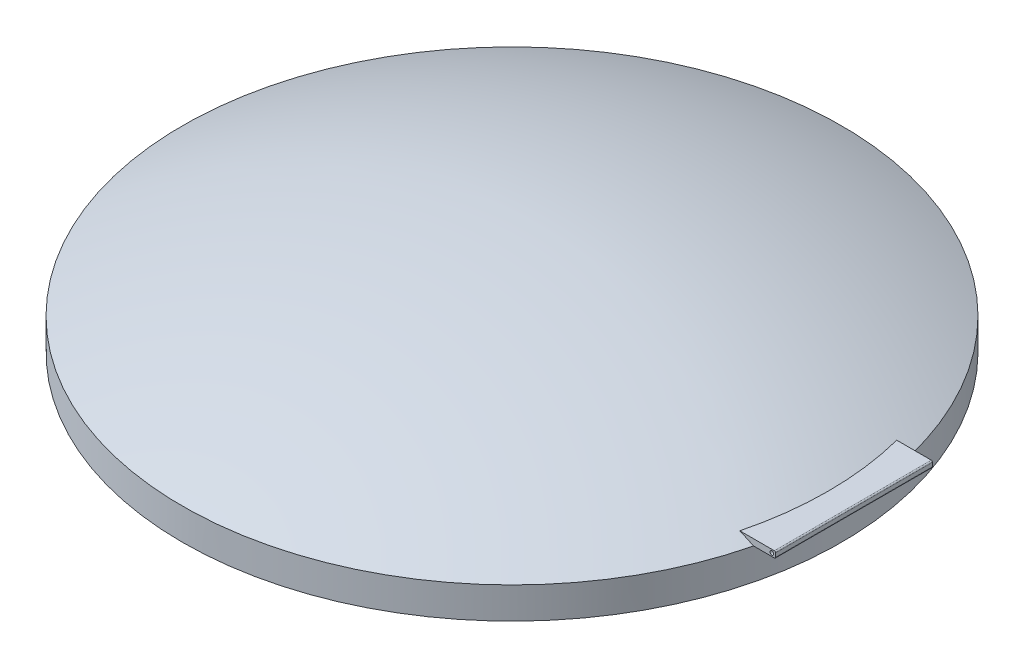
ISO-10303-21;
HEADER;
FILE_DESCRIPTION(('STEP AP214'),'2;1');
FILE_NAME('part.step','',(''),(''),'','','');
FILE_SCHEMA(('AUTOMOTIVE_DESIGN { 1 0 10303 214 1 1 1 1 }'));
ENDSEC;
DATA;
#1=APPLICATION_CONTEXT('core data for automotive mechanical design processes');
#2=APPLICATION_PROTOCOL_DEFINITION('international standard','automotive_design',2000,#1);
#3=PRODUCT_CONTEXT('',#1,'mechanical');
#4=PRODUCT('Part','Part','',(#3));
#5=PRODUCT_RELATED_PRODUCT_CATEGORY('part','',(#4));
#6=PRODUCT_DEFINITION_FORMATION('','',#4);
#7=PRODUCT_DEFINITION_CONTEXT('part definition',#1,'design');
#8=PRODUCT_DEFINITION('design','',#6,#7);
#9=PRODUCT_DEFINITION_SHAPE('','',#8);
#10=(LENGTH_UNIT() NAMED_UNIT(*) SI_UNIT(.MILLI.,.METRE.));
#11=(NAMED_UNIT(*) PLANE_ANGLE_UNIT() SI_UNIT($,.RADIAN.));
#12=(NAMED_UNIT(*) SI_UNIT($,.STERADIAN.) SOLID_ANGLE_UNIT());
#13=UNCERTAINTY_MEASURE_WITH_UNIT(LENGTH_MEASURE(1.E-05),#10,'distance_accuracy_value','');
#14=(GEOMETRIC_REPRESENTATION_CONTEXT(3) GLOBAL_UNCERTAINTY_ASSIGNED_CONTEXT((#13)) GLOBAL_UNIT_ASSIGNED_CONTEXT((#10,
#11,#12)) REPRESENTATION_CONTEXT('',''));
#15=CARTESIAN_POINT('',(0.,0.,0.));
#16=DIRECTION('',(0.,0.,1.));
#17=DIRECTION('',(1.,0.,0.));
#18=AXIS2_PLACEMENT_3D('',#15,#16,#17);
#19=CARTESIAN_POINT('',(0.,0.25,0.));
#20=DIRECTION('',(0.,-1.,0.));
#21=DIRECTION('',(0.,0.,-1.));
#22=AXIS2_PLACEMENT_3D('',#19,#20,#21);
#23=CYLINDRICAL_SURFACE('',#22,2.625);
#24=CARTESIAN_POINT('',(0.,0.25,0.));
#25=DIRECTION('',(0.,1.,0.));
#26=DIRECTION('',(0.,0.,1.));
#27=AXIS2_PLACEMENT_3D('',#24,#25,#26);
#28=CIRCLE('',#27,2.625);
#29=CARTESIAN_POINT('',(2.54950975679639,0.25,0.624999999999999));
#30=VERTEX_POINT('',#29);
#31=CARTESIAN_POINT('',(2.54950975679639,0.25,-0.624999999999999));
#32=VERTEX_POINT('',#31);
#33=EDGE_CURVE('E127',#30,#32,#28,.T.);
#34=ORIENTED_EDGE('',*,*,#33,.F.);
#35=EDGE_CURVE('E126',#32,#30,#28,.T.);
#36=ORIENTED_EDGE('',*,*,#35,.F.);
#37=EDGE_LOOP('',(#34,#36));
#38=FACE_BOUND('',#37,.T.);
#39=CARTESIAN_POINT('',(0.,0.,0.));
#40=DIRECTION('',(0.,1.,0.));
#41=DIRECTION('',(0.,0.,1.));
#42=AXIS2_PLACEMENT_3D('',#39,#40,#41);
#43=CIRCLE('',#42,2.625);
#44=CARTESIAN_POINT('',(0.,0.,2.625));
#45=VERTEX_POINT('',#44);
#46=EDGE_CURVE('E121',#45,#45,#43,.T.);
#47=ORIENTED_EDGE('',*,*,#46,.T.);
#48=EDGE_LOOP('',(#47));
#49=FACE_BOUND('',#48,.T.);
#50=ADVANCED_FACE('F32',(#38,#49),#23,.T.);
#51=CARTESIAN_POINT('',(0.,-5.1921875,0.));
#52=DIRECTION('',(0.,0.,1.));
#53=DIRECTION('',(1.,0.,0.));
#54=AXIS2_PLACEMENT_3D('',#51,#52,#53);
#55=SPHERICAL_SURFACE('',#54,6.0421875);
#56=CARTESIAN_POINT('',(0.,-5.19218750000001,0.624999999999952));
#57=DIRECTION('',(0.,0.,1.));
#58=DIRECTION('',(0.,-1.,0.));
#59=AXIS2_PLACEMENT_3D('',#56,#57,#58);
#60=CIRCLE('',#59,6.00977576829255);
#61=CARTESIAN_POINT('',(2.43993468150277,0.299999999999998,0.625));
#62=VERTEX_POINT('',#61);
#63=EDGE_CURVE('E92',#30,#62,#60,.T.);
#64=ORIENTED_EDGE('',*,*,#63,.T.);
#65=CARTESIAN_POINT('',(0.,0.299999999999998,0.));
#66=DIRECTION('',(0.,1.,0.));
#67=DIRECTION('',(0.,0.,1.));
#68=AXIS2_PLACEMENT_3D('',#65,#66,#67);
#69=CIRCLE('',#68,2.51871122798943);
#70=CARTESIAN_POINT('',(2.43993468150277,0.299999999999998,-0.625));
#71=VERTEX_POINT('',#70);
#72=EDGE_CURVE('E86',#62,#71,#69,.T.);
#73=ORIENTED_EDGE('',*,*,#72,.T.);
#74=CARTESIAN_POINT('',(0.,-5.1921875,-0.625));
#75=DIRECTION('',(0.,0.,-1.));
#76=DIRECTION('',(-1.,0.,0.));
#77=AXIS2_PLACEMENT_3D('',#74,#75,#76);
#78=CIRCLE('',#77,6.00977576829255);
#79=EDGE_CURVE('E89',#71,#32,#78,.T.);
#80=ORIENTED_EDGE('',*,*,#79,.T.);
#81=ORIENTED_EDGE('',*,*,#35,.T.);
#82=EDGE_LOOP('',(#64,#73,#80,#81));
#83=FACE_BOUND('',#82,.T.);
#84=ADVANCED_FACE('F88',(#83),#55,.T.);
#85=CARTESIAN_POINT('',(0.,0.,0.));
#86=DIRECTION('',(0.,1.,0.));
#87=DIRECTION('',(0.,0.,1.));
#88=AXIS2_PLACEMENT_3D('',#85,#86,#87);
#89=PLANE('',#88);
#90=CARTESIAN_POINT('',(0.,0.,0.));
#91=DIRECTION('',(0.,1.,0.));
#92=DIRECTION('',(0.,0.,1.));
#93=AXIS2_PLACEMENT_3D('',#90,#91,#92);
#94=CIRCLE('',#93,2.525);
#95=CARTESIAN_POINT('',(0.,0.,2.525));
#96=VERTEX_POINT('',#95);
#97=EDGE_CURVE('E110',#96,#96,#94,.T.);
#98=ORIENTED_EDGE('',*,*,#97,.T.);
#99=EDGE_LOOP('',(#98));
#100=FACE_BOUND('',#99,.T.);
#101=ORIENTED_EDGE('',*,*,#46,.F.);
#102=EDGE_LOOP('',(#101));
#103=FACE_BOUND('',#102,.T.);
#104=ADVANCED_FACE('F188',(#100,#103),#89,.F.);
#105=CARTESIAN_POINT('',(0.,0.25,0.));
#106=DIRECTION('',(0.,-1.,0.));
#107=DIRECTION('',(0.,0.,-1.));
#108=AXIS2_PLACEMENT_3D('',#105,#106,#107);
#109=CYLINDRICAL_SURFACE('',#108,2.525);
#110=CARTESIAN_POINT('',(0.,0.186842829451234,0.));
#111=DIRECTION('',(0.,-1.,0.));
#112=DIRECTION('',(0.,0.,-1.));
#113=AXIS2_PLACEMENT_3D('',#110,#111,#112);
#114=CIRCLE('',#113,2.525);
#115=CARTESIAN_POINT('',(0.,0.186842829451234,-2.525));
#116=VERTEX_POINT('',#115);
#117=EDGE_CURVE('E118',#116,#116,#114,.F.);
#118=ORIENTED_EDGE('',*,*,#117,.T.);
#119=EDGE_LOOP('',(#118));
#120=FACE_BOUND('',#119,.T.);
#121=ORIENTED_EDGE('',*,*,#97,.F.);
#122=EDGE_LOOP('',(#121));
#123=FACE_BOUND('',#122,.T.);
#124=ADVANCED_FACE('F176',(#120,#123),#109,.F.);
#125=CARTESIAN_POINT('',(0.,-5.1921875,0.));
#126=DIRECTION('',(0.,0.,1.));
#127=DIRECTION('',(1.,0.,0.));
#128=AXIS2_PLACEMENT_3D('',#125,#126,#127);
#129=SPHERICAL_SURFACE('',#128,5.9421875);
#130=CARTESIAN_POINT('',(0.,-5.1921875,0.));
#131=DIRECTION('',(0.,-1.,0.));
#132=DIRECTION('',(0.,0.,-1.));
#133=AXIS2_PLACEMENT_3D('',#130,#131,#132);
#134=SPHERICAL_SURFACE('',#133,5.9421875);
#135=ORIENTED_EDGE('',*,*,#117,.F.);
#136=EDGE_LOOP('',(#135));
#137=FACE_BOUND('',#136,.T.);
#138=ADVANCED_FACE('F169',(#137),#134,.F.);
#139=CARTESIAN_POINT('',(-500000.,0.3,0.625));
#140=DIRECTION('',(0.,0.,1.));
#141=DIRECTION('',(0.,-1.,0.));
#142=AXIS2_PLACEMENT_3D('',#139,#140,#141);
#143=PLANE('',#142);
#144=CARTESIAN_POINT('',(2.695,0.275,0.624999999999998));
#145=DIRECTION('',(0.,0.,1.));
#146=DIRECTION('',(1.,0.,0.));
#147=AXIS2_PLACEMENT_3D('',#144,#145,#146);
#148=CIRCLE('',#147,0.0149999999999997);
#149=CARTESIAN_POINT('',(2.71,0.275,0.624999999999998));
#150=VERTEX_POINT('',#149);
#151=EDGE_CURVE('E151',#150,#150,#148,.T.);
#152=ORIENTED_EDGE('',*,*,#151,.F.);
#153=EDGE_LOOP('',(#152));
#154=FACE_BOUND('',#153,.T.);
#155=DIRECTION('',(1.,0.,0.));
#156=VECTOR('',#155,1.);
#157=CARTESIAN_POINT('',(-500000.,0.25,0.625));
#158=LINE('',#157,#156);
#159=CARTESIAN_POINT('',(2.71499999990965,0.25,0.625));
#160=VERTEX_POINT('',#159);
#161=EDGE_CURVE('E112',#30,#160,#158,.T.);
#162=ORIENTED_EDGE('',*,*,#161,.T.);
#163=CARTESIAN_POINT('',(2.715,0.26,0.625));
#164=DIRECTION('',(0.,0.,1.));
#165=DIRECTION('',(0.,-1.,0.));
#166=AXIS2_PLACEMENT_3D('',#163,#164,#165);
#167=CIRCLE('',#166,0.01);
#168=CARTESIAN_POINT('',(2.725,0.26,0.625));
#169=VERTEX_POINT('',#168);
#170=EDGE_CURVE('E40',#160,#169,#167,.T.);
#171=ORIENTED_EDGE('',*,*,#170,.T.);
#172=DIRECTION('',(0.,-1.,0.));
#173=VECTOR('',#172,1.);
#174=CARTESIAN_POINT('',(2.725,0.3,0.625));
#175=LINE('',#174,#173);
#176=CARTESIAN_POINT('',(2.725,0.29,0.625));
#177=VERTEX_POINT('',#176);
#178=EDGE_CURVE('E144',#177,#169,#175,.T.);
#179=ORIENTED_EDGE('',*,*,#178,.F.);
#180=CARTESIAN_POINT('',(2.715,0.29,0.625));
#181=DIRECTION('',(0.,0.,1.));
#182=DIRECTION('',(0.,-1.,0.));
#183=AXIS2_PLACEMENT_3D('',#180,#181,#182);
#184=CIRCLE('',#183,0.01);
#185=CARTESIAN_POINT('',(2.71499999990965,0.3,0.625));
#186=VERTEX_POINT('',#185);
#187=EDGE_CURVE('E47',#177,#186,#184,.T.);
#188=ORIENTED_EDGE('',*,*,#187,.T.);
#189=DIRECTION('',(1.,0.,0.));
#190=VECTOR('',#189,1.);
#191=CARTESIAN_POINT('',(-500000.,0.3,0.625));
#192=LINE('',#191,#190);
#193=EDGE_CURVE('E108',#62,#186,#192,.T.);
#194=ORIENTED_EDGE('',*,*,#193,.F.);
#195=ORIENTED_EDGE('',*,*,#63,.F.);
#196=EDGE_LOOP('',(#162,#171,#179,#188,#194,#195));
#197=FACE_BOUND('',#196,.T.);
#198=ADVANCED_FACE('F143',(#154,#197),#143,.T.);
#199=CARTESIAN_POINT('',(-500000.,0.25,0.625));
#200=DIRECTION('',(0.,-1.,0.));
#201=DIRECTION('',(0.,0.,-1.));
#202=AXIS2_PLACEMENT_3D('',#199,#200,#201);
#203=PLANE('',#202);
#204=DIRECTION('',(1.,0.,0.));
#205=VECTOR('',#204,1.);
#206=CARTESIAN_POINT('',(-500000.,0.25,-0.625));
#207=LINE('',#206,#205);
#208=CARTESIAN_POINT('',(2.71499999990965,0.25,-0.625));
#209=VERTEX_POINT('',#208);
#210=EDGE_CURVE('E104',#32,#209,#207,.T.);
#211=ORIENTED_EDGE('',*,*,#210,.T.);
#212=DIRECTION('',(0.,0.,-1.));
#213=VECTOR('',#212,1.);
#214=CARTESIAN_POINT('',(2.71500000002334,0.25,0.625));
#215=LINE('',#214,#213);
#216=EDGE_CURVE('E55',#209,#160,#215,.F.);
#217=ORIENTED_EDGE('',*,*,#216,.T.);
#218=ORIENTED_EDGE('',*,*,#161,.F.);
#219=ORIENTED_EDGE('',*,*,#33,.T.);
#220=EDGE_LOOP('',(#211,#217,#218,#219));
#221=FACE_BOUND('',#220,.T.);
#222=ADVANCED_FACE('F154',(#221),#203,.T.);
#223=CARTESIAN_POINT('',(-500000.,0.3,-0.625));
#224=DIRECTION('',(0.,1.,0.));
#225=DIRECTION('',(0.,0.,1.));
#226=AXIS2_PLACEMENT_3D('',#223,#224,#225);
#227=PLANE('',#226);
#228=ORIENTED_EDGE('',*,*,#193,.T.);
#229=DIRECTION('',(0.,0.,1.));
#230=VECTOR('',#229,1.);
#231=CARTESIAN_POINT('',(2.71500000002334,0.3,-0.625));
#232=LINE('',#231,#230);
#233=CARTESIAN_POINT('',(2.71499999990965,0.3,-0.625));
#234=VERTEX_POINT('',#233);
#235=EDGE_CURVE('E11',#186,#234,#232,.F.);
#236=ORIENTED_EDGE('',*,*,#235,.T.);
#237=DIRECTION('',(1.,0.,0.));
#238=VECTOR('',#237,1.);
#239=CARTESIAN_POINT('',(-500000.,0.3,-0.625));
#240=LINE('',#239,#238);
#241=EDGE_CURVE('E102',#71,#234,#240,.T.);
#242=ORIENTED_EDGE('',*,*,#241,.F.);
#243=ORIENTED_EDGE('',*,*,#72,.F.);
#244=EDGE_LOOP('',(#228,#236,#242,#243));
#245=FACE_BOUND('',#244,.T.);
#246=ADVANCED_FACE('F106',(#245),#227,.T.);
#247=CARTESIAN_POINT('',(-500000.,0.25,-0.625));
#248=DIRECTION('',(0.,0.,-1.));
#249=DIRECTION('',(-1.,0.,0.));
#250=AXIS2_PLACEMENT_3D('',#247,#248,#249);
#251=PLANE('',#250);
#252=CARTESIAN_POINT('',(2.695,0.275,-0.625));
#253=DIRECTION('',(0.,0.,-1.));
#254=DIRECTION('',(-1.,0.,0.));
#255=AXIS2_PLACEMENT_3D('',#252,#253,#254);
#256=CIRCLE('',#255,0.0149999999999997);
#257=CARTESIAN_POINT('',(2.68,0.275,-0.625));
#258=VERTEX_POINT('',#257);
#259=EDGE_CURVE('E160',#258,#258,#256,.F.);
#260=ORIENTED_EDGE('',*,*,#259,.T.);
#261=EDGE_LOOP('',(#260));
#262=FACE_BOUND('',#261,.T.);
#263=DIRECTION('',(0.,1.,0.));
#264=VECTOR('',#263,1.);
#265=CARTESIAN_POINT('',(2.725,0.25,-0.625));
#266=LINE('',#265,#264);
#267=CARTESIAN_POINT('',(2.725,0.26,-0.625));
#268=VERTEX_POINT('',#267);
#269=CARTESIAN_POINT('',(2.725,0.29,-0.625));
#270=VERTEX_POINT('',#269);
#271=EDGE_CURVE('E95',#268,#270,#266,.T.);
#272=ORIENTED_EDGE('',*,*,#271,.F.);
#273=CARTESIAN_POINT('',(2.715,0.26,-0.625));
#274=DIRECTION('',(0.,0.,-1.));
#275=DIRECTION('',(-1.,0.,0.));
#276=AXIS2_PLACEMENT_3D('',#273,#274,#275);
#277=CIRCLE('',#276,0.01);
#278=EDGE_CURVE('E138',#268,#209,#277,.T.);
#279=ORIENTED_EDGE('',*,*,#278,.T.);
#280=ORIENTED_EDGE('',*,*,#210,.F.);
#281=ORIENTED_EDGE('',*,*,#79,.F.);
#282=ORIENTED_EDGE('',*,*,#241,.T.);
#283=CARTESIAN_POINT('',(2.715,0.29,-0.625));
#284=DIRECTION('',(0.,0.,-1.));
#285=DIRECTION('',(-1.,0.,0.));
#286=AXIS2_PLACEMENT_3D('',#283,#284,#285);
#287=CIRCLE('',#286,0.01);
#288=EDGE_CURVE('E136',#234,#270,#287,.T.);
#289=ORIENTED_EDGE('',*,*,#288,.T.);
#290=EDGE_LOOP('',(#272,#279,#280,#281,#282,#289));
#291=FACE_BOUND('',#290,.T.);
#292=ADVANCED_FACE('F101',(#262,#291),#251,.T.);
#293=CARTESIAN_POINT('',(2.725,0.,0.));
#294=DIRECTION('',(1.,0.,0.));
#295=DIRECTION('',(0.,0.,-1.));
#296=AXIS2_PLACEMENT_3D('',#293,#294,#295);
#297=PLANE('',#296);
#298=ORIENTED_EDGE('',*,*,#178,.T.);
#299=DIRECTION('',(0.,0.,-1.));
#300=VECTOR('',#299,1.);
#301=CARTESIAN_POINT('',(2.725,0.26,0.));
#302=LINE('',#301,#300);
#303=EDGE_CURVE('E133',#169,#268,#302,.T.);
#304=ORIENTED_EDGE('',*,*,#303,.T.);
#305=ORIENTED_EDGE('',*,*,#271,.T.);
#306=DIRECTION('',(0.,0.,1.));
#307=VECTOR('',#306,1.);
#308=CARTESIAN_POINT('',(2.725,0.29,0.));
#309=LINE('',#308,#307);
#310=EDGE_CURVE('E130',#270,#177,#309,.T.);
#311=ORIENTED_EDGE('',*,*,#310,.T.);
#312=EDGE_LOOP('',(#298,#304,#305,#311));
#313=FACE_BOUND('',#312,.T.);
#314=ADVANCED_FACE('F148',(#313),#297,.T.);
#315=CARTESIAN_POINT('',(2.715,0.26,0.));
#316=DIRECTION('',(0.,0.,-1.));
#317=DIRECTION('',(-1.,0.,0.));
#318=AXIS2_PLACEMENT_3D('',#315,#316,#317);
#319=CYLINDRICAL_SURFACE('',#318,0.01);
#320=ORIENTED_EDGE('',*,*,#170,.F.);
#321=ORIENTED_EDGE('',*,*,#216,.F.);
#322=ORIENTED_EDGE('',*,*,#278,.F.);
#323=ORIENTED_EDGE('',*,*,#303,.F.);
#324=EDGE_LOOP('',(#320,#321,#322,#323));
#325=FACE_BOUND('',#324,.T.);
#326=ADVANCED_FACE('F153',(#325),#319,.T.);
#327=CARTESIAN_POINT('',(2.715,0.29,0.));
#328=DIRECTION('',(0.,0.,1.));
#329=DIRECTION('',(0.,-1.,0.));
#330=AXIS2_PLACEMENT_3D('',#327,#328,#329);
#331=CYLINDRICAL_SURFACE('',#330,0.01);
#332=ORIENTED_EDGE('',*,*,#288,.F.);
#333=ORIENTED_EDGE('',*,*,#235,.F.);
#334=ORIENTED_EDGE('',*,*,#187,.F.);
#335=ORIENTED_EDGE('',*,*,#310,.F.);
#336=EDGE_LOOP('',(#332,#333,#334,#335));
#337=FACE_BOUND('',#336,.T.);
#338=ADVANCED_FACE('F34',(#337),#331,.T.);
#339=CARTESIAN_POINT('',(2.695,0.275,-2.626));
#340=DIRECTION('',(0.,0.,1.));
#341=DIRECTION('',(1.,0.,0.));
#342=AXIS2_PLACEMENT_3D('',#339,#340,#341);
#343=CYLINDRICAL_SURFACE('',#342,0.0149999999999997);
#344=ORIENTED_EDGE('',*,*,#259,.F.);
#345=EDGE_LOOP('',(#344));
#346=FACE_BOUND('',#345,.T.);
#347=ORIENTED_EDGE('',*,*,#151,.T.);
#348=EDGE_LOOP('',(#347));
#349=FACE_BOUND('',#348,.T.);
#350=ADVANCED_FACE('F166',(#346,#349),#343,.F.);
#351=CLOSED_SHELL('',(#50,#84,#104,#124,#138,#198,#222,#246,#292,#314,#326,#338,#350));
#352=MANIFOLD_SOLID_BREP('B2',#351);
#353=ADVANCED_BREP_SHAPE_REPRESENTATION('',(#18,#352),#14);
#354=SHAPE_DEFINITION_REPRESENTATION(#9,#353);
ENDSEC;
END-ISO-10303-21;
